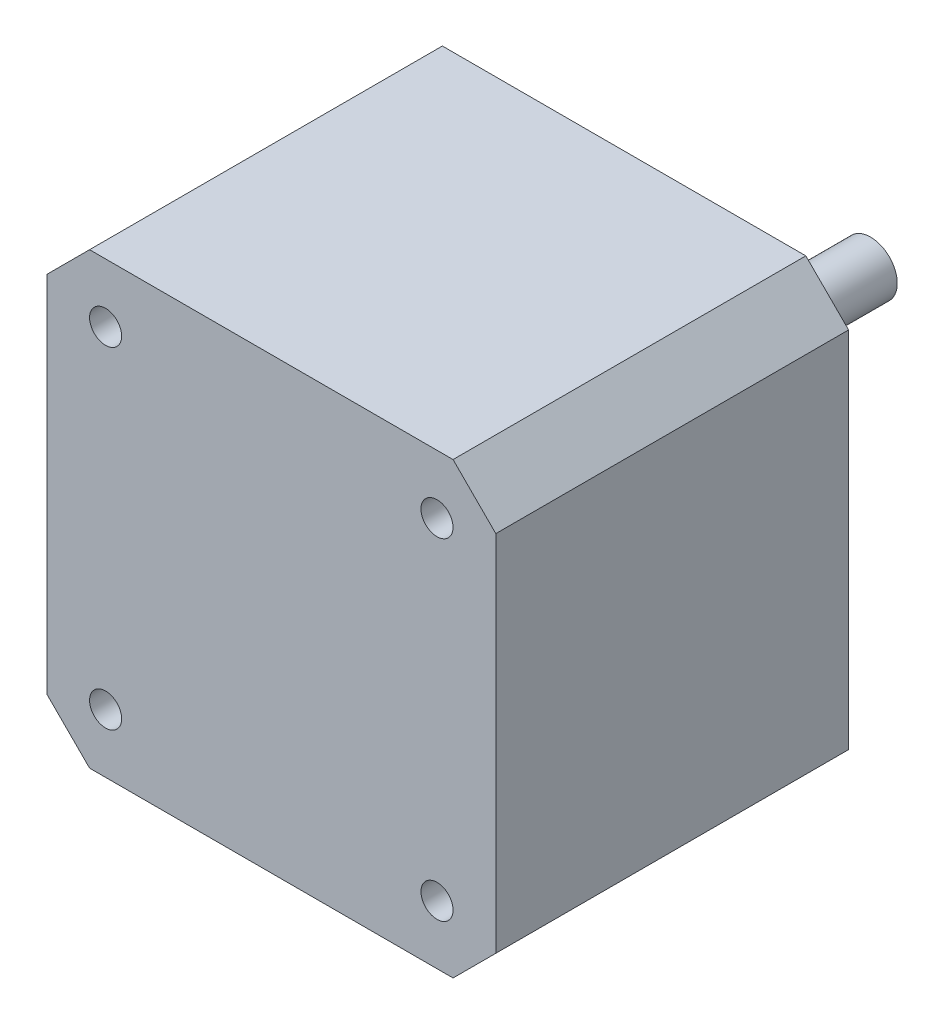
ISO-10303-21;
HEADER;
FILE_DESCRIPTION(('STEP AP214'),'2;1');
FILE_NAME('part.step','',(''),(''),'','','');
FILE_SCHEMA(('AUTOMOTIVE_DESIGN { 1 0 10303 214 1 1 1 1 }'));
ENDSEC;
DATA;
#1=APPLICATION_CONTEXT('core data for automotive mechanical design processes');
#2=APPLICATION_PROTOCOL_DEFINITION('international standard','automotive_design',2000,#1);
#3=PRODUCT_CONTEXT('',#1,'mechanical');
#4=PRODUCT('Part','Part','',(#3));
#5=PRODUCT_RELATED_PRODUCT_CATEGORY('part','',(#4));
#6=PRODUCT_DEFINITION_FORMATION('','',#4);
#7=PRODUCT_DEFINITION_CONTEXT('part definition',#1,'design');
#8=PRODUCT_DEFINITION('design','',#6,#7);
#9=PRODUCT_DEFINITION_SHAPE('','',#8);
#10=(LENGTH_UNIT() NAMED_UNIT(*) SI_UNIT(.MILLI.,.METRE.));
#11=(NAMED_UNIT(*) PLANE_ANGLE_UNIT() SI_UNIT($,.RADIAN.));
#12=(NAMED_UNIT(*) SI_UNIT($,.STERADIAN.) SOLID_ANGLE_UNIT());
#13=UNCERTAINTY_MEASURE_WITH_UNIT(LENGTH_MEASURE(1.E-05),#10,'distance_accuracy_value','');
#14=(GEOMETRIC_REPRESENTATION_CONTEXT(3) GLOBAL_UNCERTAINTY_ASSIGNED_CONTEXT((#13)) GLOBAL_UNIT_ASSIGNED_CONTEXT((#10,
#11,#12)) REPRESENTATION_CONTEXT('',''));
#15=CARTESIAN_POINT('',(0.,0.,0.));
#16=DIRECTION('',(0.,0.,1.));
#17=DIRECTION('',(1.,0.,0.));
#18=AXIS2_PLACEMENT_3D('',#15,#16,#17);
#19=CARTESIAN_POINT('',(0.,0.,-1.3));
#20=DIRECTION('',(0.,0.,-1.));
#21=DIRECTION('',(-1.,0.,0.));
#22=AXIS2_PLACEMENT_3D('',#19,#20,#21);
#23=PLANE('',#22);
#24=CARTESIAN_POINT('',(0.,0.,-1.3));
#25=DIRECTION('',(0.,0.,-1.));
#26=DIRECTION('',(-1.,0.,0.));
#27=AXIS2_PLACEMENT_3D('',#24,#25,#26);
#28=CIRCLE('',#27,11.);
#29=CARTESIAN_POINT('',(-11.,0.,-1.3));
#30=VERTEX_POINT('',#29);
#31=EDGE_CURVE('E205',#30,#30,#28,.T.);
#32=ORIENTED_EDGE('',*,*,#31,.T.);
#33=EDGE_LOOP('',(#32));
#34=FACE_BOUND('',#33,.T.);
#35=CARTESIAN_POINT('',(0.,0.,-1.3));
#36=DIRECTION('',(0.,0.,-1.));
#37=DIRECTION('',(-1.,0.,0.));
#38=AXIS2_PLACEMENT_3D('',#35,#36,#37);
#39=CIRCLE('',#38,2.5);
#40=CARTESIAN_POINT('',(-2.5,0.,-1.3));
#41=VERTEX_POINT('',#40);
#42=EDGE_CURVE('E222',#41,#41,#39,.T.);
#43=ORIENTED_EDGE('',*,*,#42,.F.);
#44=EDGE_LOOP('',(#43));
#45=FACE_BOUND('',#44,.T.);
#46=ADVANCED_FACE('F38',(#34,#45),#23,.T.);
#47=CARTESIAN_POINT('',(0.,0.,0.));
#48=DIRECTION('',(0.,0.,-1.));
#49=DIRECTION('',(-1.,0.,0.));
#50=AXIS2_PLACEMENT_3D('',#47,#48,#49);
#51=PLANE('',#50);
#52=CARTESIAN_POINT('',(-15.5,-15.5,0.));
#53=DIRECTION('',(0.,0.,-1.));
#54=DIRECTION('',(1.,0.,0.));
#55=AXIS2_PLACEMENT_3D('',#52,#53,#54);
#56=CIRCLE('',#55,1.5);
#57=CARTESIAN_POINT('',(-14.,-15.5,0.));
#58=VERTEX_POINT('',#57);
#59=EDGE_CURVE('E253',#58,#58,#56,.T.);
#60=ORIENTED_EDGE('',*,*,#59,.F.);
#61=EDGE_LOOP('',(#60));
#62=FACE_BOUND('',#61,.T.);
#63=CARTESIAN_POINT('',(15.5,-15.5,0.));
#64=DIRECTION('',(0.,0.,-1.));
#65=DIRECTION('',(-1.,0.,0.));
#66=AXIS2_PLACEMENT_3D('',#63,#64,#65);
#67=CIRCLE('',#66,1.5);
#68=CARTESIAN_POINT('',(14.,-15.5,0.));
#69=VERTEX_POINT('',#68);
#70=EDGE_CURVE('E245',#69,#69,#67,.T.);
#71=ORIENTED_EDGE('',*,*,#70,.F.);
#72=EDGE_LOOP('',(#71));
#73=FACE_BOUND('',#72,.T.);
#74=CARTESIAN_POINT('',(15.5,15.5,0.));
#75=DIRECTION('',(0.,0.,-1.));
#76=DIRECTION('',(1.,0.,0.));
#77=AXIS2_PLACEMENT_3D('',#74,#75,#76);
#78=CIRCLE('',#77,1.5);
#79=CARTESIAN_POINT('',(17.,15.5,0.));
#80=VERTEX_POINT('',#79);
#81=EDGE_CURVE('E237',#80,#80,#78,.T.);
#82=ORIENTED_EDGE('',*,*,#81,.F.);
#83=EDGE_LOOP('',(#82));
#84=FACE_BOUND('',#83,.T.);
#85=CARTESIAN_POINT('',(-15.5,15.5,0.));
#86=DIRECTION('',(0.,0.,-1.));
#87=DIRECTION('',(-1.,0.,0.));
#88=AXIS2_PLACEMENT_3D('',#85,#86,#87);
#89=CIRCLE('',#88,1.5);
#90=CARTESIAN_POINT('',(-17.,15.5,0.));
#91=VERTEX_POINT('',#90);
#92=EDGE_CURVE('E229',#91,#91,#89,.T.);
#93=ORIENTED_EDGE('',*,*,#92,.F.);
#94=EDGE_LOOP('',(#93));
#95=FACE_BOUND('',#94,.T.);
#96=DIRECTION('',(1.,0.,0.));
#97=VECTOR('',#96,1.);
#98=CARTESIAN_POINT('',(-21.,-21.,0.));
#99=LINE('',#98,#97);
#100=CARTESIAN_POINT('',(-17.,-21.,0.));
#101=VERTEX_POINT('',#100);
#102=CARTESIAN_POINT('',(17.,-21.,0.));
#103=VERTEX_POINT('',#102);
#104=EDGE_CURVE('E138',#101,#103,#99,.T.);
#105=ORIENTED_EDGE('',*,*,#104,.F.);
#106=DIRECTION('',(0.707106781186546,-0.707106781186549,0.));
#107=VECTOR('',#106,1.);
#108=CARTESIAN_POINT('',(-19.,-19.,0.));
#109=LINE('',#108,#107);
#110=CARTESIAN_POINT('',(-21.,-17.,0.));
#111=VERTEX_POINT('',#110);
#112=EDGE_CURVE('E120',#101,#111,#109,.F.);
#113=ORIENTED_EDGE('',*,*,#112,.T.);
#114=DIRECTION('',(0.,-1.,0.));
#115=VECTOR('',#114,1.);
#116=CARTESIAN_POINT('',(-21.,-21.,0.));
#117=LINE('',#116,#115);
#118=CARTESIAN_POINT('',(-21.,17.,0.));
#119=VERTEX_POINT('',#118);
#120=EDGE_CURVE('E151',#119,#111,#117,.T.);
#121=ORIENTED_EDGE('',*,*,#120,.F.);
#122=DIRECTION('',(-0.707106781186549,-0.707106781186546,0.));
#123=VECTOR('',#122,1.);
#124=CARTESIAN_POINT('',(-19.,19.,0.));
#125=LINE('',#124,#123);
#126=CARTESIAN_POINT('',(-17.,21.,0.));
#127=VERTEX_POINT('',#126);
#128=EDGE_CURVE('E166',#119,#127,#125,.F.);
#129=ORIENTED_EDGE('',*,*,#128,.T.);
#130=DIRECTION('',(-1.,0.,0.));
#131=VECTOR('',#130,1.);
#132=CARTESIAN_POINT('',(-21.,21.,0.));
#133=LINE('',#132,#131);
#134=CARTESIAN_POINT('',(17.,21.,0.));
#135=VERTEX_POINT('',#134);
#136=EDGE_CURVE('E158',#135,#127,#133,.T.);
#137=ORIENTED_EDGE('',*,*,#136,.F.);
#138=DIRECTION('',(-0.707106781186546,0.707106781186549,0.));
#139=VECTOR('',#138,1.);
#140=CARTESIAN_POINT('',(19.,19.,0.));
#141=LINE('',#140,#139);
#142=CARTESIAN_POINT('',(21.,17.,0.));
#143=VERTEX_POINT('',#142);
#144=EDGE_CURVE('E143',#135,#143,#141,.F.);
#145=ORIENTED_EDGE('',*,*,#144,.T.);
#146=DIRECTION('',(0.,1.,0.));
#147=VECTOR('',#146,1.);
#148=CARTESIAN_POINT('',(21.,-21.,0.));
#149=LINE('',#148,#147);
#150=CARTESIAN_POINT('',(21.,-17.,0.));
#151=VERTEX_POINT('',#150);
#152=EDGE_CURVE('E203',#151,#143,#149,.T.);
#153=ORIENTED_EDGE('',*,*,#152,.F.);
#154=DIRECTION('',(0.707106781186549,0.707106781186546,0.));
#155=VECTOR('',#154,1.);
#156=CARTESIAN_POINT('',(19.,-19.,0.));
#157=LINE('',#156,#155);
#158=EDGE_CURVE('E132',#151,#103,#157,.F.);
#159=ORIENTED_EDGE('',*,*,#158,.T.);
#160=EDGE_LOOP('',(#105,#113,#121,#129,#137,#145,#153,#159));
#161=FACE_BOUND('',#160,.T.);
#162=CARTESIAN_POINT('',(0.,0.,0.));
#163=DIRECTION('',(0.,0.,-1.));
#164=DIRECTION('',(-1.,0.,0.));
#165=AXIS2_PLACEMENT_3D('',#162,#163,#164);
#166=CIRCLE('',#165,11.);
#167=CARTESIAN_POINT('',(-11.,0.,0.));
#168=VERTEX_POINT('',#167);
#169=EDGE_CURVE('E214',#168,#168,#166,.T.);
#170=ORIENTED_EDGE('',*,*,#169,.F.);
#171=EDGE_LOOP('',(#170));
#172=FACE_BOUND('',#171,.T.);
#173=ADVANCED_FACE('F146',(#62,#73,#84,#95,#161,#172),#51,.T.);
#174=CARTESIAN_POINT('',(21.,-21.,33.));
#175=DIRECTION('',(-1.,0.,0.));
#176=DIRECTION('',(0.,0.,1.));
#177=AXIS2_PLACEMENT_3D('',#174,#175,#176);
#178=PLANE('',#177);
#179=DIRECTION('',(0.,1.,0.));
#180=VECTOR('',#179,1.);
#181=CARTESIAN_POINT('',(21.,-21.,33.));
#182=LINE('',#181,#180);
#183=CARTESIAN_POINT('',(21.,-17.,33.));
#184=VERTEX_POINT('',#183);
#185=CARTESIAN_POINT('',(21.,17.,33.));
#186=VERTEX_POINT('',#185);
#187=EDGE_CURVE('E150',#184,#186,#182,.T.);
#188=ORIENTED_EDGE('',*,*,#187,.F.);
#189=DIRECTION('',(0.,0.,-1.));
#190=VECTOR('',#189,1.);
#191=CARTESIAN_POINT('',(21.,-17.,33.));
#192=LINE('',#191,#190);
#193=EDGE_CURVE('E190',#184,#151,#192,.T.);
#194=ORIENTED_EDGE('',*,*,#193,.T.);
#195=ORIENTED_EDGE('',*,*,#152,.T.);
#196=DIRECTION('',(0.,0.,1.));
#197=VECTOR('',#196,1.);
#198=CARTESIAN_POINT('',(21.,17.,33.));
#199=LINE('',#198,#197);
#200=EDGE_CURVE('E187',#143,#186,#199,.T.);
#201=ORIENTED_EDGE('',*,*,#200,.T.);
#202=EDGE_LOOP('',(#188,#194,#195,#201));
#203=FACE_BOUND('',#202,.T.);
#204=ADVANCED_FACE('F273',(#203),#178,.F.);
#205=CARTESIAN_POINT('',(-21.,21.,33.));
#206=DIRECTION('',(0.,-1.,0.));
#207=DIRECTION('',(0.,0.,-1.));
#208=AXIS2_PLACEMENT_3D('',#205,#206,#207);
#209=PLANE('',#208);
#210=ORIENTED_EDGE('',*,*,#136,.T.);
#211=DIRECTION('',(0.,0.,1.));
#212=VECTOR('',#211,1.);
#213=CARTESIAN_POINT('',(-17.,21.,33.));
#214=LINE('',#213,#212);
#215=CARTESIAN_POINT('',(-17.,21.,33.));
#216=VERTEX_POINT('',#215);
#217=EDGE_CURVE('E11',#127,#216,#214,.T.);
#218=ORIENTED_EDGE('',*,*,#217,.T.);
#219=DIRECTION('',(-1.,0.,0.));
#220=VECTOR('',#219,1.);
#221=CARTESIAN_POINT('',(-21.,21.,33.));
#222=LINE('',#221,#220);
#223=CARTESIAN_POINT('',(17.,21.,33.));
#224=VERTEX_POINT('',#223);
#225=EDGE_CURVE('E155',#224,#216,#222,.T.);
#226=ORIENTED_EDGE('',*,*,#225,.F.);
#227=DIRECTION('',(0.,0.,-1.));
#228=VECTOR('',#227,1.);
#229=CARTESIAN_POINT('',(17.,21.,33.));
#230=LINE('',#229,#228);
#231=EDGE_CURVE('E47',#224,#135,#230,.T.);
#232=ORIENTED_EDGE('',*,*,#231,.T.);
#233=EDGE_LOOP('',(#210,#218,#226,#232));
#234=FACE_BOUND('',#233,.T.);
#235=ADVANCED_FACE('F199',(#234),#209,.F.);
#236=CARTESIAN_POINT('',(-21.,-21.,33.));
#237=DIRECTION('',(1.,0.,0.));
#238=DIRECTION('',(0.,0.,-1.));
#239=AXIS2_PLACEMENT_3D('',#236,#237,#238);
#240=PLANE('',#239);
#241=ORIENTED_EDGE('',*,*,#120,.T.);
#242=DIRECTION('',(0.,0.,1.));
#243=VECTOR('',#242,1.);
#244=CARTESIAN_POINT('',(-21.,-17.,33.));
#245=LINE('',#244,#243);
#246=CARTESIAN_POINT('',(-21.,-17.,33.));
#247=VERTEX_POINT('',#246);
#248=EDGE_CURVE('E125',#111,#247,#245,.T.);
#249=ORIENTED_EDGE('',*,*,#248,.T.);
#250=DIRECTION('',(0.,-1.,0.));
#251=VECTOR('',#250,1.);
#252=CARTESIAN_POINT('',(-21.,-21.,33.));
#253=LINE('',#252,#251);
#254=CARTESIAN_POINT('',(-21.,17.,33.));
#255=VERTEX_POINT('',#254);
#256=EDGE_CURVE('E209',#255,#247,#253,.T.);
#257=ORIENTED_EDGE('',*,*,#256,.F.);
#258=DIRECTION('',(0.,0.,-1.));
#259=VECTOR('',#258,1.);
#260=CARTESIAN_POINT('',(-21.,17.,33.));
#261=LINE('',#260,#259);
#262=EDGE_CURVE('E131',#255,#119,#261,.T.);
#263=ORIENTED_EDGE('',*,*,#262,.T.);
#264=EDGE_LOOP('',(#241,#249,#257,#263));
#265=FACE_BOUND('',#264,.T.);
#266=ADVANCED_FACE('F313',(#265),#240,.F.);
#267=CARTESIAN_POINT('',(-21.,-21.,33.));
#268=DIRECTION('',(0.,1.,0.));
#269=DIRECTION('',(0.,0.,1.));
#270=AXIS2_PLACEMENT_3D('',#267,#268,#269);
#271=PLANE('',#270);
#272=DIRECTION('',(1.,0.,0.));
#273=VECTOR('',#272,1.);
#274=CARTESIAN_POINT('',(-21.,-21.,33.));
#275=LINE('',#274,#273);
#276=CARTESIAN_POINT('',(-17.,-21.,33.));
#277=VERTEX_POINT('',#276);
#278=CARTESIAN_POINT('',(17.,-21.,33.));
#279=VERTEX_POINT('',#278);
#280=EDGE_CURVE('E141',#277,#279,#275,.T.);
#281=ORIENTED_EDGE('',*,*,#280,.F.);
#282=DIRECTION('',(0.,0.,-1.));
#283=VECTOR('',#282,1.);
#284=CARTESIAN_POINT('',(-17.,-21.,33.));
#285=LINE('',#284,#283);
#286=EDGE_CURVE('E124',#277,#101,#285,.T.);
#287=ORIENTED_EDGE('',*,*,#286,.T.);
#288=ORIENTED_EDGE('',*,*,#104,.T.);
#289=DIRECTION('',(0.,0.,1.));
#290=VECTOR('',#289,1.);
#291=CARTESIAN_POINT('',(17.,-21.,33.));
#292=LINE('',#291,#290);
#293=EDGE_CURVE('E144',#103,#279,#292,.T.);
#294=ORIENTED_EDGE('',*,*,#293,.T.);
#295=EDGE_LOOP('',(#281,#287,#288,#294));
#296=FACE_BOUND('',#295,.T.);
#297=ADVANCED_FACE('F137',(#296),#271,.F.);
#298=CARTESIAN_POINT('',(0.,0.,33.));
#299=DIRECTION('',(0.,0.,-1.));
#300=DIRECTION('',(-1.,0.,0.));
#301=AXIS2_PLACEMENT_3D('',#298,#299,#300);
#302=PLANE('',#301);
#303=CARTESIAN_POINT('',(-15.5,-15.5,33.));
#304=DIRECTION('',(0.,0.,-1.));
#305=DIRECTION('',(1.,0.,0.));
#306=AXIS2_PLACEMENT_3D('',#303,#304,#305);
#307=CIRCLE('',#306,1.5);
#308=CARTESIAN_POINT('',(-14.,-15.5,33.));
#309=VERTEX_POINT('',#308);
#310=EDGE_CURVE('E249',#309,#309,#307,.T.);
#311=ORIENTED_EDGE('',*,*,#310,.T.);
#312=EDGE_LOOP('',(#311));
#313=FACE_BOUND('',#312,.T.);
#314=CARTESIAN_POINT('',(15.5,-15.5,33.));
#315=DIRECTION('',(0.,0.,-1.));
#316=DIRECTION('',(-1.,0.,0.));
#317=AXIS2_PLACEMENT_3D('',#314,#315,#316);
#318=CIRCLE('',#317,1.5);
#319=CARTESIAN_POINT('',(14.,-15.5,33.));
#320=VERTEX_POINT('',#319);
#321=EDGE_CURVE('E241',#320,#320,#318,.T.);
#322=ORIENTED_EDGE('',*,*,#321,.T.);
#323=EDGE_LOOP('',(#322));
#324=FACE_BOUND('',#323,.T.);
#325=CARTESIAN_POINT('',(15.5,15.5,33.));
#326=DIRECTION('',(0.,0.,-1.));
#327=DIRECTION('',(1.,0.,0.));
#328=AXIS2_PLACEMENT_3D('',#325,#326,#327);
#329=CIRCLE('',#328,1.5);
#330=CARTESIAN_POINT('',(17.,15.5,33.));
#331=VERTEX_POINT('',#330);
#332=EDGE_CURVE('E233',#331,#331,#329,.T.);
#333=ORIENTED_EDGE('',*,*,#332,.T.);
#334=EDGE_LOOP('',(#333));
#335=FACE_BOUND('',#334,.T.);
#336=CARTESIAN_POINT('',(-15.5,15.5,33.));
#337=DIRECTION('',(0.,0.,-1.));
#338=DIRECTION('',(-1.,0.,0.));
#339=AXIS2_PLACEMENT_3D('',#336,#337,#338);
#340=CIRCLE('',#339,1.5);
#341=CARTESIAN_POINT('',(-17.,15.5,33.));
#342=VERTEX_POINT('',#341);
#343=EDGE_CURVE('E226',#342,#342,#340,.T.);
#344=ORIENTED_EDGE('',*,*,#343,.T.);
#345=EDGE_LOOP('',(#344));
#346=FACE_BOUND('',#345,.T.);
#347=ORIENTED_EDGE('',*,*,#256,.T.);
#348=DIRECTION('',(-0.707106781186546,0.707106781186549,0.));
#349=VECTOR('',#348,1.);
#350=CARTESIAN_POINT('',(-17.,-21.,33.));
#351=LINE('',#350,#349);
#352=EDGE_CURVE('E184',#247,#277,#351,.F.);
#353=ORIENTED_EDGE('',*,*,#352,.T.);
#354=ORIENTED_EDGE('',*,*,#280,.T.);
#355=DIRECTION('',(-0.707106781186549,-0.707106781186546,0.));
#356=VECTOR('',#355,1.);
#357=CARTESIAN_POINT('',(21.,-17.,33.));
#358=LINE('',#357,#356);
#359=EDGE_CURVE('E181',#279,#184,#358,.F.);
#360=ORIENTED_EDGE('',*,*,#359,.T.);
#361=ORIENTED_EDGE('',*,*,#187,.T.);
#362=DIRECTION('',(0.707106781186546,-0.707106781186549,0.));
#363=VECTOR('',#362,1.);
#364=CARTESIAN_POINT('',(17.,21.,33.));
#365=LINE('',#364,#363);
#366=EDGE_CURVE('E65',#186,#224,#365,.F.);
#367=ORIENTED_EDGE('',*,*,#366,.T.);
#368=ORIENTED_EDGE('',*,*,#225,.T.);
#369=DIRECTION('',(0.707106781186549,0.707106781186546,0.));
#370=VECTOR('',#369,1.);
#371=CARTESIAN_POINT('',(-21.,17.,33.));
#372=LINE('',#371,#370);
#373=EDGE_CURVE('E178',#216,#255,#372,.F.);
#374=ORIENTED_EDGE('',*,*,#373,.T.);
#375=EDGE_LOOP('',(#347,#353,#354,#360,#361,#367,#368,#374));
#376=FACE_BOUND('',#375,.T.);
#377=ADVANCED_FACE('F261',(#313,#324,#335,#346,#376),#302,.F.);
#378=CARTESIAN_POINT('',(-17.,-21.,33.));
#379=DIRECTION('',(0.707106781186549,0.707106781186546,0.));
#380=DIRECTION('',(0.,0.,-1.));
#381=AXIS2_PLACEMENT_3D('',#378,#379,#380);
#382=PLANE('',#381);
#383=ORIENTED_EDGE('',*,*,#352,.F.);
#384=ORIENTED_EDGE('',*,*,#248,.F.);
#385=ORIENTED_EDGE('',*,*,#112,.F.);
#386=ORIENTED_EDGE('',*,*,#286,.F.);
#387=EDGE_LOOP('',(#383,#384,#385,#386));
#388=FACE_BOUND('',#387,.T.);
#389=ADVANCED_FACE('F123',(#388),#382,.F.);
#390=CARTESIAN_POINT('',(21.,-17.,33.));
#391=DIRECTION('',(-0.707106781186546,0.707106781186549,0.));
#392=DIRECTION('',(0.,0.,-1.));
#393=AXIS2_PLACEMENT_3D('',#390,#391,#392);
#394=PLANE('',#393);
#395=ORIENTED_EDGE('',*,*,#359,.F.);
#396=ORIENTED_EDGE('',*,*,#293,.F.);
#397=ORIENTED_EDGE('',*,*,#158,.F.);
#398=ORIENTED_EDGE('',*,*,#193,.F.);
#399=EDGE_LOOP('',(#395,#396,#397,#398));
#400=FACE_BOUND('',#399,.T.);
#401=ADVANCED_FACE('F324',(#400),#394,.F.);
#402=CARTESIAN_POINT('',(-21.,17.,33.));
#403=DIRECTION('',(0.707106781186546,-0.707106781186549,0.));
#404=DIRECTION('',(0.,0.,-1.));
#405=AXIS2_PLACEMENT_3D('',#402,#403,#404);
#406=PLANE('',#405);
#407=ORIENTED_EDGE('',*,*,#373,.F.);
#408=ORIENTED_EDGE('',*,*,#217,.F.);
#409=ORIENTED_EDGE('',*,*,#128,.F.);
#410=ORIENTED_EDGE('',*,*,#262,.F.);
#411=EDGE_LOOP('',(#407,#408,#409,#410));
#412=FACE_BOUND('',#411,.T.);
#413=ADVANCED_FACE('F326',(#412),#406,.F.);
#414=CARTESIAN_POINT('',(17.,21.,33.));
#415=DIRECTION('',(-0.707106781186549,-0.707106781186546,0.));
#416=DIRECTION('',(0.,0.,-1.));
#417=AXIS2_PLACEMENT_3D('',#414,#415,#416);
#418=PLANE('',#417);
#419=ORIENTED_EDGE('',*,*,#366,.F.);
#420=ORIENTED_EDGE('',*,*,#200,.F.);
#421=ORIENTED_EDGE('',*,*,#144,.F.);
#422=ORIENTED_EDGE('',*,*,#231,.F.);
#423=EDGE_LOOP('',(#419,#420,#421,#422));
#424=FACE_BOUND('',#423,.T.);
#425=ADVANCED_FACE('F40',(#424),#418,.F.);
#426=CARTESIAN_POINT('',(0.,0.,-1.3));
#427=DIRECTION('',(0.,0.,1.));
#428=DIRECTION('',(1.,0.,0.));
#429=AXIS2_PLACEMENT_3D('',#426,#427,#428);
#430=CYLINDRICAL_SURFACE('',#429,11.);
#431=ORIENTED_EDGE('',*,*,#31,.F.);
#432=EDGE_LOOP('',(#431));
#433=FACE_BOUND('',#432,.T.);
#434=ORIENTED_EDGE('',*,*,#169,.T.);
#435=EDGE_LOOP('',(#434));
#436=FACE_BOUND('',#435,.T.);
#437=ADVANCED_FACE('F305',(#433,#436),#430,.T.);
#438=CARTESIAN_POINT('',(0.,0.,-23.05));
#439=DIRECTION('',(0.,0.,1.));
#440=DIRECTION('',(1.,0.,0.));
#441=AXIS2_PLACEMENT_3D('',#438,#439,#440);
#442=CYLINDRICAL_SURFACE('',#441,2.5);
#443=CARTESIAN_POINT('',(0.,0.,-23.05));
#444=DIRECTION('',(0.,0.,-1.));
#445=DIRECTION('',(-1.,0.,0.));
#446=AXIS2_PLACEMENT_3D('',#443,#444,#445);
#447=CIRCLE('',#446,2.5);
#448=CARTESIAN_POINT('',(-2.5,0.,-23.05));
#449=VERTEX_POINT('',#448);
#450=EDGE_CURVE('E218',#449,#449,#447,.T.);
#451=ORIENTED_EDGE('',*,*,#450,.F.);
#452=EDGE_LOOP('',(#451));
#453=FACE_BOUND('',#452,.T.);
#454=ORIENTED_EDGE('',*,*,#42,.T.);
#455=EDGE_LOOP('',(#454));
#456=FACE_BOUND('',#455,.T.);
#457=ADVANCED_FACE('F293',(#453,#456),#442,.T.);
#458=CARTESIAN_POINT('',(0.,0.,-23.05));
#459=DIRECTION('',(0.,0.,-1.));
#460=DIRECTION('',(-1.,0.,0.));
#461=AXIS2_PLACEMENT_3D('',#458,#459,#460);
#462=PLANE('',#461);
#463=ORIENTED_EDGE('',*,*,#450,.T.);
#464=EDGE_LOOP('',(#463));
#465=FACE_BOUND('',#464,.T.);
#466=ADVANCED_FACE('F284',(#465),#462,.T.);
#467=CARTESIAN_POINT('',(-15.5,15.5,33.));
#468=DIRECTION('',(0.,0.,-1.));
#469=DIRECTION('',(-1.,0.,0.));
#470=AXIS2_PLACEMENT_3D('',#467,#468,#469);
#471=CYLINDRICAL_SURFACE('',#470,1.5);
#472=ORIENTED_EDGE('',*,*,#343,.F.);
#473=EDGE_LOOP('',(#472));
#474=FACE_BOUND('',#473,.T.);
#475=ORIENTED_EDGE('',*,*,#92,.T.);
#476=EDGE_LOOP('',(#475));
#477=FACE_BOUND('',#476,.T.);
#478=ADVANCED_FACE('F281',(#474,#477),#471,.F.);
#479=CARTESIAN_POINT('',(15.5,15.5,33.));
#480=DIRECTION('',(0.,0.,-1.));
#481=DIRECTION('',(-1.,0.,0.));
#482=AXIS2_PLACEMENT_3D('',#479,#480,#481);
#483=CYLINDRICAL_SURFACE('',#482,1.5);
#484=ORIENTED_EDGE('',*,*,#332,.F.);
#485=EDGE_LOOP('',(#484));
#486=FACE_BOUND('',#485,.T.);
#487=ORIENTED_EDGE('',*,*,#81,.T.);
#488=EDGE_LOOP('',(#487));
#489=FACE_BOUND('',#488,.T.);
#490=ADVANCED_FACE('F283',(#486,#489),#483,.F.);
#491=CARTESIAN_POINT('',(15.5,-15.5,33.));
#492=DIRECTION('',(0.,0.,-1.));
#493=DIRECTION('',(-1.,0.,0.));
#494=AXIS2_PLACEMENT_3D('',#491,#492,#493);
#495=CYLINDRICAL_SURFACE('',#494,1.5);
#496=ORIENTED_EDGE('',*,*,#321,.F.);
#497=EDGE_LOOP('',(#496));
#498=FACE_BOUND('',#497,.T.);
#499=ORIENTED_EDGE('',*,*,#70,.T.);
#500=EDGE_LOOP('',(#499));
#501=FACE_BOUND('',#500,.T.);
#502=ADVANCED_FACE('F267',(#498,#501),#495,.F.);
#503=CARTESIAN_POINT('',(-15.5,-15.5,33.));
#504=DIRECTION('',(0.,0.,-1.));
#505=DIRECTION('',(-1.,0.,0.));
#506=AXIS2_PLACEMENT_3D('',#503,#504,#505);
#507=CYLINDRICAL_SURFACE('',#506,1.5);
#508=ORIENTED_EDGE('',*,*,#310,.F.);
#509=EDGE_LOOP('',(#508));
#510=FACE_BOUND('',#509,.T.);
#511=ORIENTED_EDGE('',*,*,#59,.T.);
#512=EDGE_LOOP('',(#511));
#513=FACE_BOUND('',#512,.T.);
#514=ADVANCED_FACE('F264',(#510,#513),#507,.F.);
#515=CLOSED_SHELL('',(#46,#173,#204,#235,#266,#297,#377,#389,#401,#413,#425,#437,#457,#466,#478,
#490,#502,#514));
#516=MANIFOLD_SOLID_BREP('B2',#515);
#517=ADVANCED_BREP_SHAPE_REPRESENTATION('',(#18,#516),#14);
#518=SHAPE_DEFINITION_REPRESENTATION(#9,#517);
ENDSEC;
END-ISO-10303-21;
